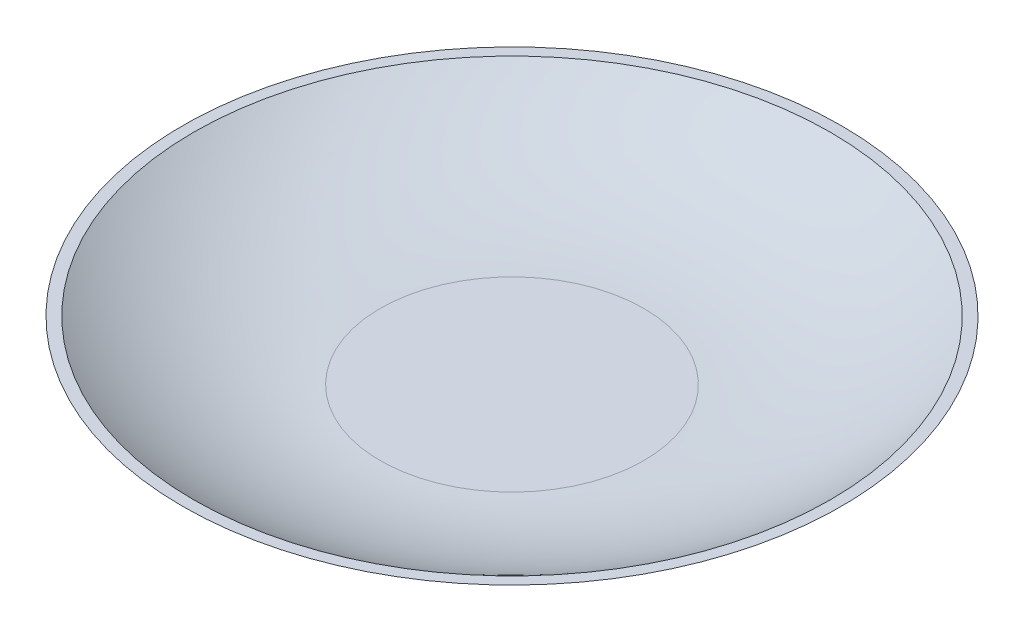
ISO-10303-21;
HEADER;
FILE_DESCRIPTION(('STEP AP214'),'2;1');
FILE_NAME('part.step','',(''),(''),'','','');
FILE_SCHEMA(('AUTOMOTIVE_DESIGN { 1 0 10303 214 1 1 1 1 }'));
ENDSEC;
DATA;
#1=APPLICATION_CONTEXT('core data for automotive mechanical design processes');
#2=APPLICATION_PROTOCOL_DEFINITION('international standard','automotive_design',2000,#1);
#3=PRODUCT_CONTEXT('',#1,'mechanical');
#4=PRODUCT('Part','Part','',(#3));
#5=PRODUCT_RELATED_PRODUCT_CATEGORY('part','',(#4));
#6=PRODUCT_DEFINITION_FORMATION('','',#4);
#7=PRODUCT_DEFINITION_CONTEXT('part definition',#1,'design');
#8=PRODUCT_DEFINITION('design','',#6,#7);
#9=PRODUCT_DEFINITION_SHAPE('','',#8);
#10=(LENGTH_UNIT() NAMED_UNIT(*) SI_UNIT(.MILLI.,.METRE.));
#11=(NAMED_UNIT(*) PLANE_ANGLE_UNIT() SI_UNIT($,.RADIAN.));
#12=(NAMED_UNIT(*) SI_UNIT($,.STERADIAN.) SOLID_ANGLE_UNIT());
#13=UNCERTAINTY_MEASURE_WITH_UNIT(LENGTH_MEASURE(1.E-05),#10,'distance_accuracy_value','');
#14=(GEOMETRIC_REPRESENTATION_CONTEXT(3) GLOBAL_UNCERTAINTY_ASSIGNED_CONTEXT((#13)) GLOBAL_UNIT_ASSIGNED_CONTEXT((#10,
#11,#12)) REPRESENTATION_CONTEXT('',''));
#15=CARTESIAN_POINT('',(0.,0.,0.));
#16=DIRECTION('',(0.,0.,1.));
#17=DIRECTION('',(1.,0.,0.));
#18=AXIS2_PLACEMENT_3D('',#15,#16,#17);
#19=CARTESIAN_POINT('',(0.,-500.,0.));
#20=DIRECTION('',(0.,1.,0.));
#21=DIRECTION('',(0.,0.,1.));
#22=AXIS2_PLACEMENT_3D('',#19,#20,#21);
#23=PLANE('',#22);
#24=CARTESIAN_POINT('',(0.,-500.,0.));
#25=DIRECTION('',(0.,1.,0.));
#26=DIRECTION('',(0.,0.,1.));
#27=AXIS2_PLACEMENT_3D('',#24,#25,#26);
#28=CIRCLE('',#27,1000.);
#29=CARTESIAN_POINT('',(0.,-500.,1000.));
#30=VERTEX_POINT('',#29);
#31=EDGE_CURVE('E10',#30,#30,#28,.F.);
#32=ORIENTED_EDGE('',*,*,#31,.T.);
#33=EDGE_LOOP('',(#32));
#34=FACE_BOUND('',#33,.T.);
#35=ADVANCED_FACE('F34',(#34),#23,.F.);
#36=CARTESIAN_POINT('',(0.,0.,0.));
#37=DIRECTION('',(0.,1.,0.));
#38=DIRECTION('',(0.,0.,1.));
#39=AXIS2_PLACEMENT_3D('',#36,#37,#38);
#40=PLANE('',#39);
#41=CARTESIAN_POINT('',(0.,0.,0.));
#42=DIRECTION('',(0.,1.,0.));
#43=DIRECTION('',(0.,0.,1.));
#44=AXIS2_PLACEMENT_3D('',#41,#42,#43);
#45=CIRCLE('',#44,2415.09716980849);
#46=CARTESIAN_POINT('',(0.,0.,2415.09716980849));
#47=VERTEX_POINT('',#46);
#48=EDGE_CURVE('E49',#47,#47,#45,.T.);
#49=ORIENTED_EDGE('',*,*,#48,.F.);
#50=EDGE_LOOP('',(#49));
#51=FACE_BOUND('',#50,.T.);
#52=CARTESIAN_POINT('',(0.,0.,0.));
#53=DIRECTION('',(0.,1.,0.));
#54=DIRECTION('',(0.,0.,1.));
#55=AXIS2_PLACEMENT_3D('',#52,#53,#54);
#56=CIRCLE('',#55,2500.);
#57=CARTESIAN_POINT('',(0.,0.,2500.));
#58=VERTEX_POINT('',#57);
#59=EDGE_CURVE('E41',#58,#58,#56,.T.);
#60=ORIENTED_EDGE('',*,*,#59,.T.);
#61=EDGE_LOOP('',(#60));
#62=FACE_BOUND('',#61,.T.);
#63=ADVANCED_FACE('F57',(#51,#62),#40,.T.);
#64=CARTESIAN_POINT('',(0.,2000.,0.));
#65=DIRECTION('',(0.,-1.,0.));
#66=DIRECTION('',(0.,0.,-1.));
#67=AXIS2_PLACEMENT_3D('',#64,#65,#66);
#68=DEGENERATE_TOROIDAL_SURFACE('',#67,1000.,2500.,.T.);
#69=ORIENTED_EDGE('',*,*,#31,.F.);
#70=EDGE_LOOP('',(#69));
#71=FACE_BOUND('',#70,.T.);
#72=ORIENTED_EDGE('',*,*,#59,.F.);
#73=EDGE_LOOP('',(#72));
#74=FACE_BOUND('',#73,.T.);
#75=ADVANCED_FACE('F36',(#71,#74),#68,.T.);
#76=CARTESIAN_POINT('',(0.,-450.,0.));
#77=DIRECTION('',(0.,1.,0.));
#78=DIRECTION('',(0.,0.,1.));
#79=AXIS2_PLACEMENT_3D('',#76,#77,#78);
#80=PLANE('',#79);
#81=CARTESIAN_POINT('',(0.,-450.,0.));
#82=DIRECTION('',(0.,-1.,0.));
#83=DIRECTION('',(0.,0.,-1.));
#84=AXIS2_PLACEMENT_3D('',#81,#82,#83);
#85=CIRCLE('',#84,1000.);
#86=CARTESIAN_POINT('',(0.,-450.,-1000.));
#87=VERTEX_POINT('',#86);
#88=EDGE_CURVE('E45',#87,#87,#85,.T.);
#89=ORIENTED_EDGE('',*,*,#88,.F.);
#90=EDGE_LOOP('',(#89));
#91=FACE_BOUND('',#90,.T.);
#92=ADVANCED_FACE('F63',(#91),#80,.T.);
#93=CARTESIAN_POINT('',(0.,2000.,0.));
#94=DIRECTION('',(0.,-1.,0.));
#95=DIRECTION('',(0.,0.,-1.));
#96=AXIS2_PLACEMENT_3D('',#93,#94,#95);
#97=DEGENERATE_TOROIDAL_SURFACE('',#96,1000.,2450.,.T.);
#98=ORIENTED_EDGE('',*,*,#88,.T.);
#99=EDGE_LOOP('',(#98));
#100=FACE_BOUND('',#99,.T.);
#101=ORIENTED_EDGE('',*,*,#48,.T.);
#102=EDGE_LOOP('',(#101));
#103=FACE_BOUND('',#102,.T.);
#104=ADVANCED_FACE('F55',(#100,#103),#97,.F.);
#105=CLOSED_SHELL('',(#35,#63,#75,#92,#104));
#106=MANIFOLD_SOLID_BREP('B2',#105);
#107=ADVANCED_BREP_SHAPE_REPRESENTATION('',(#18,#106),#14);
#108=SHAPE_DEFINITION_REPRESENTATION(#9,#107);
ENDSEC;
END-ISO-10303-21;
